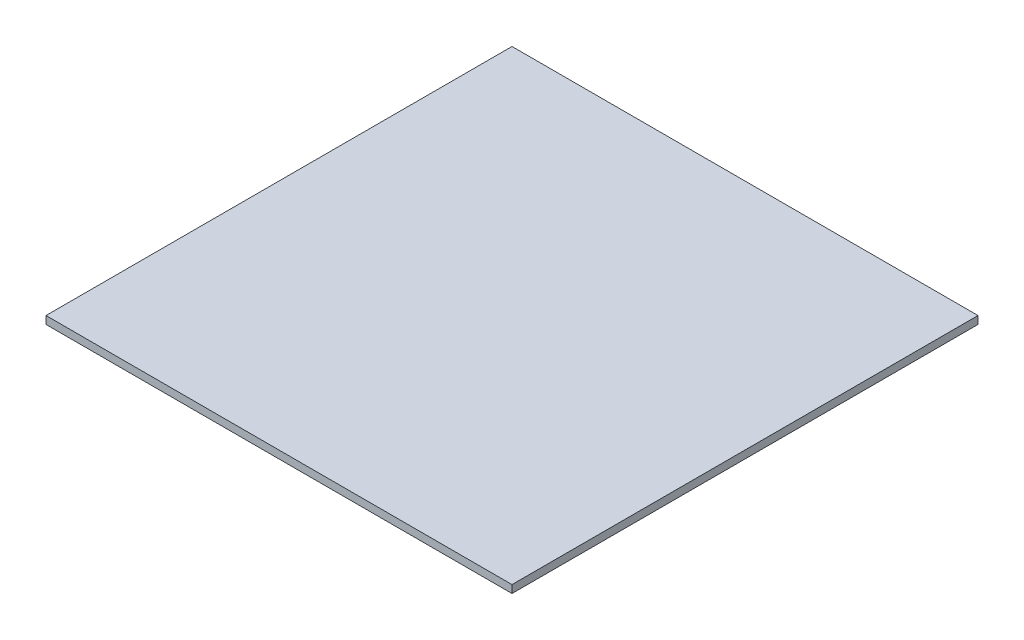
ISO-10303-21;
HEADER;
FILE_DESCRIPTION(('STEP AP214'),'2;1');
FILE_NAME('part.step','',(''),(''),'','','');
FILE_SCHEMA(('AUTOMOTIVE_DESIGN { 1 0 10303 214 1 1 1 1 }'));
ENDSEC;
DATA;
#1=APPLICATION_CONTEXT('core data for automotive mechanical design processes');
#2=APPLICATION_PROTOCOL_DEFINITION('international standard','automotive_design',2000,#1);
#3=PRODUCT_CONTEXT('',#1,'mechanical');
#4=PRODUCT('Part','Part','',(#3));
#5=PRODUCT_RELATED_PRODUCT_CATEGORY('part','',(#4));
#6=PRODUCT_DEFINITION_FORMATION('','',#4);
#7=PRODUCT_DEFINITION_CONTEXT('part definition',#1,'design');
#8=PRODUCT_DEFINITION('design','',#6,#7);
#9=PRODUCT_DEFINITION_SHAPE('','',#8);
#10=(LENGTH_UNIT() NAMED_UNIT(*) SI_UNIT(.MILLI.,.METRE.));
#11=(NAMED_UNIT(*) PLANE_ANGLE_UNIT() SI_UNIT($,.RADIAN.));
#12=(NAMED_UNIT(*) SI_UNIT($,.STERADIAN.) SOLID_ANGLE_UNIT());
#13=UNCERTAINTY_MEASURE_WITH_UNIT(LENGTH_MEASURE(1.E-05),#10,'distance_accuracy_value','');
#14=(GEOMETRIC_REPRESENTATION_CONTEXT(3) GLOBAL_UNCERTAINTY_ASSIGNED_CONTEXT((#13)) GLOBAL_UNIT_ASSIGNED_CONTEXT((#10,
#11,#12)) REPRESENTATION_CONTEXT('',''));
#15=CARTESIAN_POINT('',(0.,0.,0.));
#16=DIRECTION('',(0.,0.,1.));
#17=DIRECTION('',(1.,0.,0.));
#18=AXIS2_PLACEMENT_3D('',#15,#16,#17);
#19=CARTESIAN_POINT('',(0.,5.,0.));
#20=DIRECTION('',(1.,0.,0.));
#21=DIRECTION('',(0.,0.,-1.));
#22=AXIS2_PLACEMENT_3D('',#19,#20,#21);
#23=PLANE('',#22);
#24=DIRECTION('',(0.,0.,1.));
#25=VECTOR('',#24,1.);
#26=CARTESIAN_POINT('',(0.,0.,0.));
#27=LINE('',#26,#25);
#28=CARTESIAN_POINT('',(0.,0.,-300.));
#29=VERTEX_POINT('',#28);
#30=CARTESIAN_POINT('',(0.,0.,0.));
#31=VERTEX_POINT('',#30);
#32=EDGE_CURVE('E94',#29,#31,#27,.T.);
#33=ORIENTED_EDGE('',*,*,#32,.T.);
#34=DIRECTION('',(0.,-1.,0.));
#35=VECTOR('',#34,1.);
#36=CARTESIAN_POINT('',(0.,5.,0.));
#37=LINE('',#36,#35);
#38=CARTESIAN_POINT('',(0.,5.,0.));
#39=VERTEX_POINT('',#38);
#40=EDGE_CURVE('E11',#39,#31,#37,.T.);
#41=ORIENTED_EDGE('',*,*,#40,.F.);
#42=DIRECTION('',(0.,0.,1.));
#43=VECTOR('',#42,1.);
#44=CARTESIAN_POINT('',(0.,5.,0.));
#45=LINE('',#44,#43);
#46=CARTESIAN_POINT('',(0.,5.,-300.));
#47=VERTEX_POINT('',#46);
#48=EDGE_CURVE('E82',#47,#39,#45,.T.);
#49=ORIENTED_EDGE('',*,*,#48,.F.);
#50=DIRECTION('',(0.,-1.,0.));
#51=VECTOR('',#50,1.);
#52=CARTESIAN_POINT('',(0.,5.,-300.));
#53=LINE('',#52,#51);
#54=EDGE_CURVE('E90',#47,#29,#53,.T.);
#55=ORIENTED_EDGE('',*,*,#54,.T.);
#56=EDGE_LOOP('',(#33,#41,#49,#55));
#57=FACE_BOUND('',#56,.T.);
#58=ADVANCED_FACE('F31',(#57),#23,.F.);
#59=CARTESIAN_POINT('',(0.,5.,0.));
#60=DIRECTION('',(0.,0.,-1.));
#61=DIRECTION('',(-1.,0.,0.));
#62=AXIS2_PLACEMENT_3D('',#59,#60,#61);
#63=PLANE('',#62);
#64=DIRECTION('',(1.,0.,0.));
#65=VECTOR('',#64,1.);
#66=CARTESIAN_POINT('',(0.,0.,0.));
#67=LINE('',#66,#65);
#68=CARTESIAN_POINT('',(300.,0.,0.));
#69=VERTEX_POINT('',#68);
#70=EDGE_CURVE('E86',#31,#69,#67,.T.);
#71=ORIENTED_EDGE('',*,*,#70,.T.);
#72=DIRECTION('',(0.,-1.,0.));
#73=VECTOR('',#72,1.);
#74=CARTESIAN_POINT('',(300.,5.,0.));
#75=LINE('',#74,#73);
#76=CARTESIAN_POINT('',(300.,5.,0.));
#77=VERTEX_POINT('',#76);
#78=EDGE_CURVE('E39',#77,#69,#75,.T.);
#79=ORIENTED_EDGE('',*,*,#78,.F.);
#80=DIRECTION('',(1.,0.,0.));
#81=VECTOR('',#80,1.);
#82=CARTESIAN_POINT('',(0.,5.,0.));
#83=LINE('',#82,#81);
#84=EDGE_CURVE('E77',#39,#77,#83,.T.);
#85=ORIENTED_EDGE('',*,*,#84,.F.);
#86=ORIENTED_EDGE('',*,*,#40,.T.);
#87=EDGE_LOOP('',(#71,#79,#85,#86));
#88=FACE_BOUND('',#87,.T.);
#89=ADVANCED_FACE('F85',(#88),#63,.F.);
#90=CARTESIAN_POINT('',(300.,5.,0.));
#91=DIRECTION('',(-1.,0.,0.));
#92=DIRECTION('',(0.,0.,1.));
#93=AXIS2_PLACEMENT_3D('',#90,#91,#92);
#94=PLANE('',#93);
#95=DIRECTION('',(0.,0.,-1.));
#96=VECTOR('',#95,1.);
#97=CARTESIAN_POINT('',(300.,0.,0.));
#98=LINE('',#97,#96);
#99=CARTESIAN_POINT('',(300.,0.,-300.));
#100=VERTEX_POINT('',#99);
#101=EDGE_CURVE('E64',#69,#100,#98,.T.);
#102=ORIENTED_EDGE('',*,*,#101,.T.);
#103=DIRECTION('',(0.,-1.,0.));
#104=VECTOR('',#103,1.);
#105=CARTESIAN_POINT('',(300.,5.,-300.));
#106=LINE('',#105,#104);
#107=CARTESIAN_POINT('',(300.,5.,-300.));
#108=VERTEX_POINT('',#107);
#109=EDGE_CURVE('E87',#108,#100,#106,.T.);
#110=ORIENTED_EDGE('',*,*,#109,.F.);
#111=DIRECTION('',(0.,0.,-1.));
#112=VECTOR('',#111,1.);
#113=CARTESIAN_POINT('',(300.,5.,0.));
#114=LINE('',#113,#112);
#115=EDGE_CURVE('E80',#77,#108,#114,.T.);
#116=ORIENTED_EDGE('',*,*,#115,.F.);
#117=ORIENTED_EDGE('',*,*,#78,.T.);
#118=EDGE_LOOP('',(#102,#110,#116,#117));
#119=FACE_BOUND('',#118,.T.);
#120=ADVANCED_FACE('F88',(#119),#94,.F.);
#121=CARTESIAN_POINT('',(0.,5.,-300.));
#122=DIRECTION('',(0.,0.,1.));
#123=DIRECTION('',(1.,0.,0.));
#124=AXIS2_PLACEMENT_3D('',#121,#122,#123);
#125=PLANE('',#124);
#126=DIRECTION('',(-1.,0.,0.));
#127=VECTOR('',#126,1.);
#128=CARTESIAN_POINT('',(0.,0.,-300.));
#129=LINE('',#128,#127);
#130=EDGE_CURVE('E70',#100,#29,#129,.T.);
#131=ORIENTED_EDGE('',*,*,#130,.T.);
#132=ORIENTED_EDGE('',*,*,#54,.F.);
#133=DIRECTION('',(-1.,0.,0.));
#134=VECTOR('',#133,1.);
#135=CARTESIAN_POINT('',(0.,5.,-300.));
#136=LINE('',#135,#134);
#137=EDGE_CURVE('E47',#108,#47,#136,.T.);
#138=ORIENTED_EDGE('',*,*,#137,.F.);
#139=ORIENTED_EDGE('',*,*,#109,.T.);
#140=EDGE_LOOP('',(#131,#132,#138,#139));
#141=FACE_BOUND('',#140,.T.);
#142=ADVANCED_FACE('F101',(#141),#125,.F.);
#143=CARTESIAN_POINT('',(0.,5.,-300.));
#144=DIRECTION('',(0.,-1.,0.));
#145=DIRECTION('',(0.,0.,-1.));
#146=AXIS2_PLACEMENT_3D('',#143,#144,#145);
#147=PLANE('',#146);
#148=ORIENTED_EDGE('',*,*,#48,.T.);
#149=ORIENTED_EDGE('',*,*,#84,.T.);
#150=ORIENTED_EDGE('',*,*,#115,.T.);
#151=ORIENTED_EDGE('',*,*,#137,.T.);
#152=EDGE_LOOP('',(#148,#149,#150,#151));
#153=FACE_BOUND('',#152,.T.);
#154=ADVANCED_FACE('F78',(#153),#147,.F.);
#155=CARTESIAN_POINT('',(0.,0.,-300.));
#156=DIRECTION('',(0.,-1.,0.));
#157=DIRECTION('',(0.,0.,-1.));
#158=AXIS2_PLACEMENT_3D('',#155,#156,#157);
#159=PLANE('',#158);
#160=ORIENTED_EDGE('',*,*,#32,.F.);
#161=ORIENTED_EDGE('',*,*,#130,.F.);
#162=ORIENTED_EDGE('',*,*,#101,.F.);
#163=ORIENTED_EDGE('',*,*,#70,.F.);
#164=EDGE_LOOP('',(#160,#161,#162,#163));
#165=FACE_BOUND('',#164,.T.);
#166=ADVANCED_FACE('F104',(#165),#159,.T.);
#167=CLOSED_SHELL('',(#58,#89,#120,#142,#154,#166));
#168=MANIFOLD_SOLID_BREP('B2',#167);
#169=ADVANCED_BREP_SHAPE_REPRESENTATION('',(#18,#168),#14);
#170=SHAPE_DEFINITION_REPRESENTATION(#9,#169);
ENDSEC;
END-ISO-10303-21;
